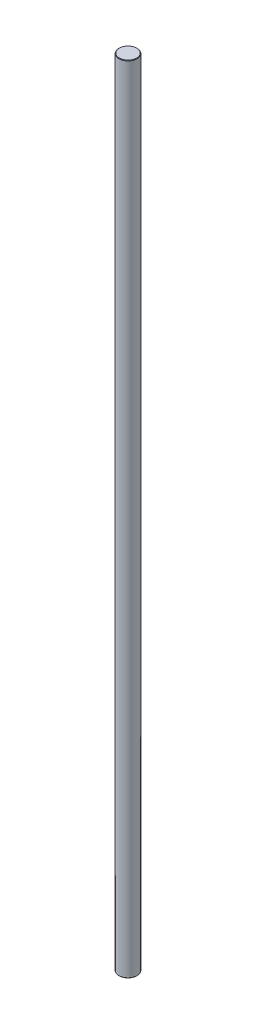
ISO-10303-21;
HEADER;
FILE_DESCRIPTION(('STEP AP214'),'2;1');
FILE_NAME('part.step','',(''),(''),'','','');
FILE_SCHEMA(('AUTOMOTIVE_DESIGN { 1 0 10303 214 1 1 1 1 }'));
ENDSEC;
DATA;
#1=APPLICATION_CONTEXT('core data for automotive mechanical design processes');
#2=APPLICATION_PROTOCOL_DEFINITION('international standard','automotive_design',2000,#1);
#3=PRODUCT_CONTEXT('',#1,'mechanical');
#4=PRODUCT('Part','Part','',(#3));
#5=PRODUCT_RELATED_PRODUCT_CATEGORY('part','',(#4));
#6=PRODUCT_DEFINITION_FORMATION('','',#4);
#7=PRODUCT_DEFINITION_CONTEXT('part definition',#1,'design');
#8=PRODUCT_DEFINITION('design','',#6,#7);
#9=PRODUCT_DEFINITION_SHAPE('','',#8);
#10=(LENGTH_UNIT() NAMED_UNIT(*) SI_UNIT(.MILLI.,.METRE.));
#11=(NAMED_UNIT(*) PLANE_ANGLE_UNIT() SI_UNIT($,.RADIAN.));
#12=(NAMED_UNIT(*) SI_UNIT($,.STERADIAN.) SOLID_ANGLE_UNIT());
#13=UNCERTAINTY_MEASURE_WITH_UNIT(LENGTH_MEASURE(1.E-05),#10,'distance_accuracy_value','');
#14=(GEOMETRIC_REPRESENTATION_CONTEXT(3) GLOBAL_UNCERTAINTY_ASSIGNED_CONTEXT((#13)) GLOBAL_UNIT_ASSIGNED_CONTEXT((#10,
#11,#12)) REPRESENTATION_CONTEXT('',''));
#15=CARTESIAN_POINT('',(0.,0.,0.));
#16=DIRECTION('',(0.,0.,1.));
#17=DIRECTION('',(1.,0.,0.));
#18=AXIS2_PLACEMENT_3D('',#15,#16,#17);
#19=CARTESIAN_POINT('',(0.,175.,0.));
#20=DIRECTION('',(0.,-1.,0.));
#21=DIRECTION('',(0.,0.,-1.));
#22=AXIS2_PLACEMENT_3D('',#19,#20,#21);
#23=CYLINDRICAL_SURFACE('',#22,4.);
#24=CARTESIAN_POINT('',(0.,-174.8,0.));
#25=DIRECTION('',(0.,1.,0.));
#26=DIRECTION('',(0.,0.,1.));
#27=AXIS2_PLACEMENT_3D('',#24,#25,#26);
#28=CIRCLE('',#27,4.);
#29=CARTESIAN_POINT('',(0.,-174.8,4.));
#30=VERTEX_POINT('',#29);
#31=EDGE_CURVE('E42',#30,#30,#28,.T.);
#32=ORIENTED_EDGE('',*,*,#31,.T.);
#33=EDGE_LOOP('',(#32));
#34=FACE_BOUND('',#33,.T.);
#35=CARTESIAN_POINT('',(0.,174.8,0.));
#36=DIRECTION('',(0.,1.,0.));
#37=DIRECTION('',(0.,0.,1.));
#38=AXIS2_PLACEMENT_3D('',#35,#36,#37);
#39=CIRCLE('',#38,4.);
#40=CARTESIAN_POINT('',(0.,174.8,4.));
#41=VERTEX_POINT('',#40);
#42=EDGE_CURVE('E46',#41,#41,#39,.F.);
#43=ORIENTED_EDGE('',*,*,#42,.T.);
#44=EDGE_LOOP('',(#43));
#45=FACE_BOUND('',#44,.T.);
#46=ADVANCED_FACE('F31',(#34,#45),#23,.T.);
#47=CARTESIAN_POINT('',(0.,175.,0.));
#48=DIRECTION('',(0.,1.,0.));
#49=DIRECTION('',(0.,0.,1.));
#50=AXIS2_PLACEMENT_3D('',#47,#48,#49);
#51=PLANE('',#50);
#52=CARTESIAN_POINT('',(0.,175.,0.));
#53=DIRECTION('',(0.,1.,0.));
#54=DIRECTION('',(0.,0.,1.));
#55=AXIS2_PLACEMENT_3D('',#52,#53,#54);
#56=CIRCLE('',#55,3.79999999999997);
#57=CARTESIAN_POINT('',(0.,175.,3.79999999999997));
#58=VERTEX_POINT('',#57);
#59=EDGE_CURVE('E10',#58,#58,#56,.T.);
#60=ORIENTED_EDGE('',*,*,#59,.T.);
#61=EDGE_LOOP('',(#60));
#62=FACE_BOUND('',#61,.T.);
#63=ADVANCED_FACE('F62',(#62),#51,.T.);
#64=CARTESIAN_POINT('',(0.,-175.,0.));
#65=DIRECTION('',(0.,1.,0.));
#66=DIRECTION('',(0.,0.,1.));
#67=AXIS2_PLACEMENT_3D('',#64,#65,#66);
#68=PLANE('',#67);
#69=CARTESIAN_POINT('',(0.,-175.,0.));
#70=DIRECTION('',(0.,1.,0.));
#71=DIRECTION('',(0.,0.,1.));
#72=AXIS2_PLACEMENT_3D('',#69,#70,#71);
#73=CIRCLE('',#72,3.80000000000003);
#74=CARTESIAN_POINT('',(0.,-175.,3.80000000000003));
#75=VERTEX_POINT('',#74);
#76=EDGE_CURVE('E38',#75,#75,#73,.F.);
#77=ORIENTED_EDGE('',*,*,#76,.T.);
#78=EDGE_LOOP('',(#77));
#79=FACE_BOUND('',#78,.T.);
#80=ADVANCED_FACE('F59',(#79),#68,.F.);
#81=CARTESIAN_POINT('',(0.,-174.8,0.));
#82=DIRECTION('',(0.,1.,0.));
#83=DIRECTION('',(0.,0.,1.));
#84=AXIS2_PLACEMENT_3D('',#81,#82,#83);
#85=CONICAL_SURFACE('',#84,4.,0.78539816339744);
#86=ORIENTED_EDGE('',*,*,#76,.F.);
#87=EDGE_LOOP('',(#86));
#88=FACE_BOUND('',#87,.T.);
#89=ORIENTED_EDGE('',*,*,#31,.F.);
#90=EDGE_LOOP('',(#89));
#91=FACE_BOUND('',#90,.T.);
#92=ADVANCED_FACE('F55',(#88,#91),#85,.T.);
#93=CARTESIAN_POINT('',(0.,175.,0.));
#94=DIRECTION('',(0.,-1.,0.));
#95=DIRECTION('',(0.,0.,-1.));
#96=AXIS2_PLACEMENT_3D('',#93,#94,#95);
#97=CONICAL_SURFACE('',#96,3.79999999999997,0.78539816339737);
#98=ORIENTED_EDGE('',*,*,#42,.F.);
#99=EDGE_LOOP('',(#98));
#100=FACE_BOUND('',#99,.T.);
#101=ORIENTED_EDGE('',*,*,#59,.F.);
#102=EDGE_LOOP('',(#101));
#103=FACE_BOUND('',#102,.T.);
#104=ADVANCED_FACE('F33',(#100,#103),#97,.T.);
#105=CLOSED_SHELL('',(#46,#63,#80,#92,#104));
#106=MANIFOLD_SOLID_BREP('B2',#105);
#107=ADVANCED_BREP_SHAPE_REPRESENTATION('',(#18,#106),#14);
#108=SHAPE_DEFINITION_REPRESENTATION(#9,#107);
ENDSEC;
END-ISO-10303-21;
